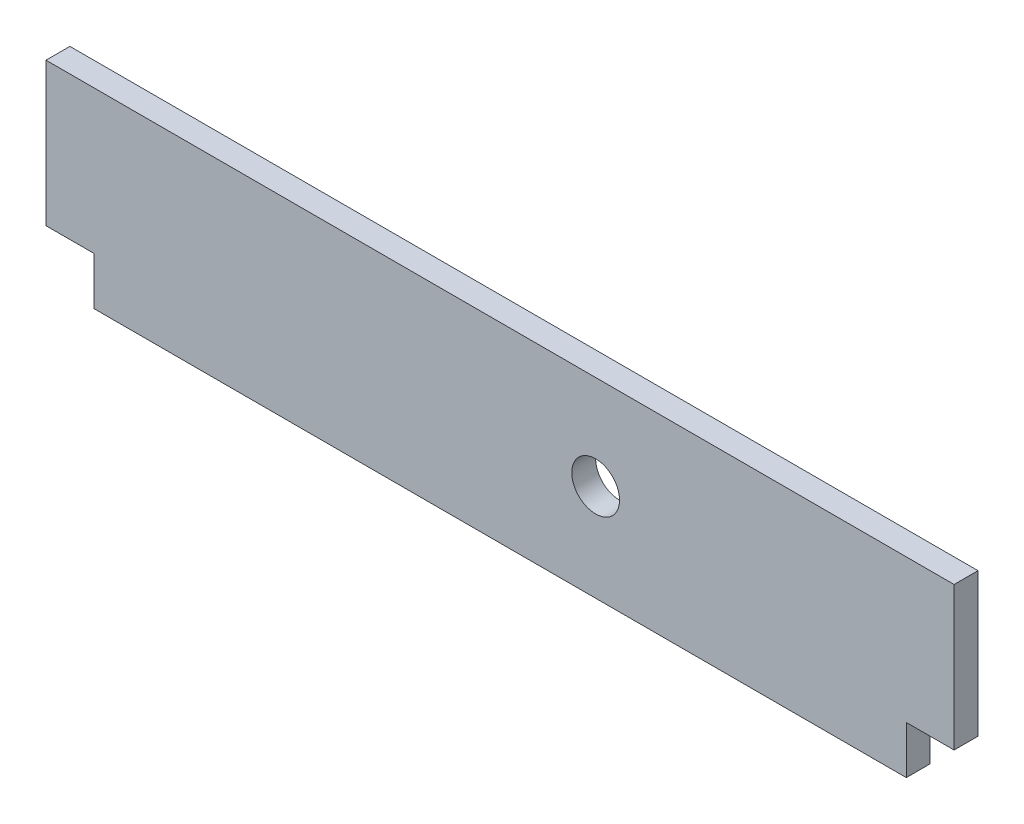
ISO-10303-21;
HEADER;
FILE_DESCRIPTION(('STEP AP214'),'2;1');
FILE_NAME('part.step','',(''),(''),'','','');
FILE_SCHEMA(('AUTOMOTIVE_DESIGN { 1 0 10303 214 1 1 1 1 }'));
ENDSEC;
DATA;
#1=APPLICATION_CONTEXT('core data for automotive mechanical design processes');
#2=APPLICATION_PROTOCOL_DEFINITION('international standard','automotive_design',2000,#1);
#3=PRODUCT_CONTEXT('',#1,'mechanical');
#4=PRODUCT('Part','Part','',(#3));
#5=PRODUCT_RELATED_PRODUCT_CATEGORY('part','',(#4));
#6=PRODUCT_DEFINITION_FORMATION('','',#4);
#7=PRODUCT_DEFINITION_CONTEXT('part definition',#1,'design');
#8=PRODUCT_DEFINITION('design','',#6,#7);
#9=PRODUCT_DEFINITION_SHAPE('','',#8);
#10=(LENGTH_UNIT() NAMED_UNIT(*) SI_UNIT(.MILLI.,.METRE.));
#11=(NAMED_UNIT(*) PLANE_ANGLE_UNIT() SI_UNIT($,.RADIAN.));
#12=(NAMED_UNIT(*) SI_UNIT($,.STERADIAN.) SOLID_ANGLE_UNIT());
#13=UNCERTAINTY_MEASURE_WITH_UNIT(LENGTH_MEASURE(1.E-05),#10,'distance_accuracy_value','');
#14=(GEOMETRIC_REPRESENTATION_CONTEXT(3) GLOBAL_UNCERTAINTY_ASSIGNED_CONTEXT((#13)) GLOBAL_UNIT_ASSIGNED_CONTEXT((#10,
#11,#12)) REPRESENTATION_CONTEXT('',''));
#15=CARTESIAN_POINT('',(0.,0.,0.));
#16=DIRECTION('',(0.,0.,1.));
#17=DIRECTION('',(1.,0.,0.));
#18=AXIS2_PLACEMENT_3D('',#15,#16,#17);
#19=CARTESIAN_POINT('',(215.9,0.,6.35));
#20=DIRECTION('',(-1.,0.,0.));
#21=DIRECTION('',(0.,-1.,0.));
#22=AXIS2_PLACEMENT_3D('',#19,#20,#21);
#23=PLANE('',#22);
#24=DIRECTION('',(0.,1.,0.));
#25=VECTOR('',#24,1.);
#26=CARTESIAN_POINT('',(215.9,0.,-6.35));
#27=LINE('',#26,#25);
#28=CARTESIAN_POINT('',(215.9,0.,-6.35));
#29=VERTEX_POINT('',#28);
#30=CARTESIAN_POINT('',(215.9,25.3999999999999,-6.35));
#31=VERTEX_POINT('',#30);
#32=EDGE_CURVE('E142',#29,#31,#27,.T.);
#33=ORIENTED_EDGE('',*,*,#32,.T.);
#34=DIRECTION('',(0.,0.,-1.));
#35=VECTOR('',#34,1.);
#36=CARTESIAN_POINT('',(215.9,25.3999999999999,6.35));
#37=LINE('',#36,#35);
#38=CARTESIAN_POINT('',(215.9,25.3999999999999,6.35));
#39=VERTEX_POINT('',#38);
#40=EDGE_CURVE('E122',#39,#31,#37,.T.);
#41=ORIENTED_EDGE('',*,*,#40,.F.);
#42=DIRECTION('',(0.,1.,0.));
#43=VECTOR('',#42,1.);
#44=CARTESIAN_POINT('',(215.9,0.,6.35));
#45=LINE('',#44,#43);
#46=CARTESIAN_POINT('',(215.9,0.,6.35));
#47=VERTEX_POINT('',#46);
#48=EDGE_CURVE('E163',#47,#39,#45,.T.);
#49=ORIENTED_EDGE('',*,*,#48,.F.);
#50=DIRECTION('',(0.,0.,-1.));
#51=VECTOR('',#50,1.);
#52=CARTESIAN_POINT('',(215.9,0.,6.35));
#53=LINE('',#52,#51);
#54=EDGE_CURVE('E125',#47,#29,#53,.T.);
#55=ORIENTED_EDGE('',*,*,#54,.T.);
#56=EDGE_LOOP('',(#33,#41,#49,#55));
#57=FACE_BOUND('',#56,.T.);
#58=ADVANCED_FACE('F42',(#57),#23,.F.);
#59=CARTESIAN_POINT('',(215.9,25.3999999999999,6.35));
#60=DIRECTION('',(0.,1.,0.));
#61=DIRECTION('',(-1.,0.,0.));
#62=AXIS2_PLACEMENT_3D('',#59,#60,#61);
#63=PLANE('',#62);
#64=DIRECTION('',(1.,0.,0.));
#65=VECTOR('',#64,1.);
#66=CARTESIAN_POINT('',(215.9,25.3999999999999,-6.35));
#67=LINE('',#66,#65);
#68=CARTESIAN_POINT('',(241.3,25.3999999999999,-6.35));
#69=VERTEX_POINT('',#68);
#70=EDGE_CURVE('E60',#31,#69,#67,.T.);
#71=ORIENTED_EDGE('',*,*,#70,.T.);
#72=DIRECTION('',(0.,0.,-1.));
#73=VECTOR('',#72,1.);
#74=CARTESIAN_POINT('',(241.3,25.3999999999999,6.35));
#75=LINE('',#74,#73);
#76=CARTESIAN_POINT('',(241.3,25.3999999999999,6.35));
#77=VERTEX_POINT('',#76);
#78=EDGE_CURVE('E119',#77,#69,#75,.T.);
#79=ORIENTED_EDGE('',*,*,#78,.F.);
#80=DIRECTION('',(1.,0.,0.));
#81=VECTOR('',#80,1.);
#82=CARTESIAN_POINT('',(215.9,25.3999999999999,6.35));
#83=LINE('',#82,#81);
#84=EDGE_CURVE('E88',#39,#77,#83,.T.);
#85=ORIENTED_EDGE('',*,*,#84,.F.);
#86=ORIENTED_EDGE('',*,*,#40,.T.);
#87=EDGE_LOOP('',(#71,#79,#85,#86));
#88=FACE_BOUND('',#87,.T.);
#89=ADVANCED_FACE('F118',(#88),#63,.F.);
#90=CARTESIAN_POINT('',(241.3,101.6,6.35));
#91=DIRECTION('',(-1.,0.,0.));
#92=DIRECTION('',(0.,-1.,0.));
#93=AXIS2_PLACEMENT_3D('',#90,#91,#92);
#94=PLANE('',#93);
#95=DIRECTION('',(0.,1.,0.));
#96=VECTOR('',#95,1.);
#97=CARTESIAN_POINT('',(241.3,101.6,-6.35));
#98=LINE('',#97,#96);
#99=CARTESIAN_POINT('',(241.3,101.6,-6.35));
#100=VERTEX_POINT('',#99);
#101=EDGE_CURVE('E115',#69,#100,#98,.T.);
#102=ORIENTED_EDGE('',*,*,#101,.T.);
#103=DIRECTION('',(0.,0.,-1.));
#104=VECTOR('',#103,1.);
#105=CARTESIAN_POINT('',(241.3,101.6,6.35));
#106=LINE('',#105,#104);
#107=CARTESIAN_POINT('',(241.3,101.6,6.35));
#108=VERTEX_POINT('',#107);
#109=EDGE_CURVE('E188',#108,#100,#106,.T.);
#110=ORIENTED_EDGE('',*,*,#109,.F.);
#111=DIRECTION('',(0.,1.,0.));
#112=VECTOR('',#111,1.);
#113=CARTESIAN_POINT('',(241.3,101.6,6.35));
#114=LINE('',#113,#112);
#115=EDGE_CURVE('E128',#77,#108,#114,.T.);
#116=ORIENTED_EDGE('',*,*,#115,.F.);
#117=ORIENTED_EDGE('',*,*,#78,.T.);
#118=EDGE_LOOP('',(#102,#110,#116,#117));
#119=FACE_BOUND('',#118,.T.);
#120=ADVANCED_FACE('F127',(#119),#94,.F.);
#121=CARTESIAN_POINT('',(-241.3,101.6,6.35));
#122=DIRECTION('',(0.,-1.,0.));
#123=DIRECTION('',(1.,0.,0.));
#124=AXIS2_PLACEMENT_3D('',#121,#122,#123);
#125=PLANE('',#124);
#126=DIRECTION('',(-1.,0.,0.));
#127=VECTOR('',#126,1.);
#128=CARTESIAN_POINT('',(-241.3,101.6,-6.35));
#129=LINE('',#128,#127);
#130=CARTESIAN_POINT('',(-241.3,101.6,-6.35));
#131=VERTEX_POINT('',#130);
#132=EDGE_CURVE('E130',#100,#131,#129,.T.);
#133=ORIENTED_EDGE('',*,*,#132,.T.);
#134=DIRECTION('',(0.,0.,-1.));
#135=VECTOR('',#134,1.);
#136=CARTESIAN_POINT('',(-241.3,101.6,6.35));
#137=LINE('',#136,#135);
#138=CARTESIAN_POINT('',(-241.3,101.6,6.35));
#139=VERTEX_POINT('',#138);
#140=EDGE_CURVE('E185',#139,#131,#137,.T.);
#141=ORIENTED_EDGE('',*,*,#140,.F.);
#142=DIRECTION('',(-1.,0.,0.));
#143=VECTOR('',#142,1.);
#144=CARTESIAN_POINT('',(-241.3,101.6,6.35));
#145=LINE('',#144,#143);
#146=EDGE_CURVE('E157',#108,#139,#145,.T.);
#147=ORIENTED_EDGE('',*,*,#146,.F.);
#148=ORIENTED_EDGE('',*,*,#109,.T.);
#149=EDGE_LOOP('',(#133,#141,#147,#148));
#150=FACE_BOUND('',#149,.T.);
#151=ADVANCED_FACE('F215',(#150),#125,.F.);
#152=CARTESIAN_POINT('',(-241.3,101.6,6.35));
#153=DIRECTION('',(1.,0.,0.));
#154=DIRECTION('',(0.,0.,-1.));
#155=AXIS2_PLACEMENT_3D('',#152,#153,#154);
#156=PLANE('',#155);
#157=DIRECTION('',(0.,-1.,0.));
#158=VECTOR('',#157,1.);
#159=CARTESIAN_POINT('',(-241.3,101.6,-6.35));
#160=LINE('',#159,#158);
#161=CARTESIAN_POINT('',(-241.3,25.4,-6.35));
#162=VERTEX_POINT('',#161);
#163=EDGE_CURVE('E186',#131,#162,#160,.T.);
#164=ORIENTED_EDGE('',*,*,#163,.T.);
#165=DIRECTION('',(0.,0.,-1.));
#166=VECTOR('',#165,1.);
#167=CARTESIAN_POINT('',(-241.3,25.4,6.35));
#168=LINE('',#167,#166);
#169=CARTESIAN_POINT('',(-241.3,25.4,6.35));
#170=VERTEX_POINT('',#169);
#171=EDGE_CURVE('E182',#170,#162,#168,.T.);
#172=ORIENTED_EDGE('',*,*,#171,.F.);
#173=DIRECTION('',(0.,-1.,0.));
#174=VECTOR('',#173,1.);
#175=CARTESIAN_POINT('',(-241.3,101.6,6.35));
#176=LINE('',#175,#174);
#177=EDGE_CURVE('E154',#139,#170,#176,.T.);
#178=ORIENTED_EDGE('',*,*,#177,.F.);
#179=ORIENTED_EDGE('',*,*,#140,.T.);
#180=EDGE_LOOP('',(#164,#172,#178,#179));
#181=FACE_BOUND('',#180,.T.);
#182=ADVANCED_FACE('F214',(#181),#156,.F.);
#183=CARTESIAN_POINT('',(-215.9,25.4,6.35));
#184=DIRECTION('',(0.,1.,0.));
#185=DIRECTION('',(0.,0.,1.));
#186=AXIS2_PLACEMENT_3D('',#183,#184,#185);
#187=PLANE('',#186);
#188=DIRECTION('',(1.,0.,0.));
#189=VECTOR('',#188,1.);
#190=CARTESIAN_POINT('',(-215.9,25.4,-6.35));
#191=LINE('',#190,#189);
#192=CARTESIAN_POINT('',(-215.9,25.4,-6.35));
#193=VERTEX_POINT('',#192);
#194=EDGE_CURVE('E183',#162,#193,#191,.T.);
#195=ORIENTED_EDGE('',*,*,#194,.T.);
#196=DIRECTION('',(0.,0.,-1.));
#197=VECTOR('',#196,1.);
#198=CARTESIAN_POINT('',(-215.9,25.4,6.35));
#199=LINE('',#198,#197);
#200=CARTESIAN_POINT('',(-215.9,25.4,6.35));
#201=VERTEX_POINT('',#200);
#202=EDGE_CURVE('E172',#201,#193,#199,.T.);
#203=ORIENTED_EDGE('',*,*,#202,.F.);
#204=DIRECTION('',(1.,0.,0.));
#205=VECTOR('',#204,1.);
#206=CARTESIAN_POINT('',(-215.9,25.4,6.35));
#207=LINE('',#206,#205);
#208=EDGE_CURVE('E151',#170,#201,#207,.T.);
#209=ORIENTED_EDGE('',*,*,#208,.F.);
#210=ORIENTED_EDGE('',*,*,#171,.T.);
#211=EDGE_LOOP('',(#195,#203,#209,#210));
#212=FACE_BOUND('',#211,.T.);
#213=ADVANCED_FACE('F204',(#212),#187,.F.);
#214=CARTESIAN_POINT('',(-215.9,25.4,6.35));
#215=DIRECTION('',(1.,0.,0.));
#216=DIRECTION('',(0.,0.,-1.));
#217=AXIS2_PLACEMENT_3D('',#214,#215,#216);
#218=PLANE('',#217);
#219=DIRECTION('',(0.,-1.,0.));
#220=VECTOR('',#219,1.);
#221=CARTESIAN_POINT('',(-215.9,25.4,-6.35));
#222=LINE('',#221,#220);
#223=CARTESIAN_POINT('',(-215.9,0.,-6.35));
#224=VERTEX_POINT('',#223);
#225=EDGE_CURVE('E179',#193,#224,#222,.T.);
#226=ORIENTED_EDGE('',*,*,#225,.T.);
#227=DIRECTION('',(0.,0.,-1.));
#228=VECTOR('',#227,1.);
#229=CARTESIAN_POINT('',(-215.9,0.,6.35));
#230=LINE('',#229,#228);
#231=CARTESIAN_POINT('',(-215.9,0.,6.35));
#232=VERTEX_POINT('',#231);
#233=EDGE_CURVE('E165',#232,#224,#230,.T.);
#234=ORIENTED_EDGE('',*,*,#233,.F.);
#235=DIRECTION('',(0.,-1.,0.));
#236=VECTOR('',#235,1.);
#237=CARTESIAN_POINT('',(-215.9,25.4,6.35));
#238=LINE('',#237,#236);
#239=EDGE_CURVE('E148',#201,#232,#238,.T.);
#240=ORIENTED_EDGE('',*,*,#239,.F.);
#241=ORIENTED_EDGE('',*,*,#202,.T.);
#242=EDGE_LOOP('',(#226,#234,#240,#241));
#243=FACE_BOUND('',#242,.T.);
#244=ADVANCED_FACE('F210',(#243),#218,.F.);
#245=CARTESIAN_POINT('',(-215.9,0.,6.35));
#246=DIRECTION('',(0.,1.,0.));
#247=DIRECTION('',(0.,0.,1.));
#248=AXIS2_PLACEMENT_3D('',#245,#246,#247);
#249=PLANE('',#248);
#250=DIRECTION('',(1.,0.,0.));
#251=VECTOR('',#250,1.);
#252=CARTESIAN_POINT('',(-215.9,0.,-6.35));
#253=LINE('',#252,#251);
#254=EDGE_CURVE('E97',#224,#29,#253,.T.);
#255=ORIENTED_EDGE('',*,*,#254,.T.);
#256=ORIENTED_EDGE('',*,*,#54,.F.);
#257=DIRECTION('',(1.,0.,0.));
#258=VECTOR('',#257,1.);
#259=CARTESIAN_POINT('',(-215.9,0.,6.35));
#260=LINE('',#259,#258);
#261=EDGE_CURVE('E145',#232,#47,#260,.T.);
#262=ORIENTED_EDGE('',*,*,#261,.F.);
#263=ORIENTED_EDGE('',*,*,#233,.T.);
#264=EDGE_LOOP('',(#255,#256,#262,#263));
#265=FACE_BOUND('',#264,.T.);
#266=ADVANCED_FACE('F231',(#265),#249,.F.);
#267=CARTESIAN_POINT('',(0.,0.,6.35));
#268=DIRECTION('',(0.,0.,-1.));
#269=DIRECTION('',(-1.,0.,0.));
#270=AXIS2_PLACEMENT_3D('',#267,#268,#269);
#271=PLANE('',#270);
#272=CARTESIAN_POINT('',(50.8000000000006,51.5000000000016,6.34999999999999));
#273=DIRECTION('',(0.,0.,-1.));
#274=DIRECTION('',(-1.,0.,0.));
#275=AXIS2_PLACEMENT_3D('',#272,#273,#274);
#276=CIRCLE('',#275,12.7000000000001);
#277=CARTESIAN_POINT('',(38.1000000000005,51.5000000000016,6.34999999999999));
#278=VERTEX_POINT('',#277);
#279=EDGE_CURVE('E11',#278,#278,#276,.F.);
#280=ORIENTED_EDGE('',*,*,#279,.F.);
#281=EDGE_LOOP('',(#280));
#282=FACE_BOUND('',#281,.T.);
#283=ORIENTED_EDGE('',*,*,#48,.T.);
#284=ORIENTED_EDGE('',*,*,#84,.T.);
#285=ORIENTED_EDGE('',*,*,#115,.T.);
#286=ORIENTED_EDGE('',*,*,#146,.T.);
#287=ORIENTED_EDGE('',*,*,#177,.T.);
#288=ORIENTED_EDGE('',*,*,#208,.T.);
#289=ORIENTED_EDGE('',*,*,#239,.T.);
#290=ORIENTED_EDGE('',*,*,#261,.T.);
#291=EDGE_LOOP('',(#283,#284,#285,#286,#287,#288,#289,#290));
#292=FACE_BOUND('',#291,.T.);
#293=ADVANCED_FACE('F44',(#282,#292),#271,.F.);
#294=CARTESIAN_POINT('',(0.,0.,-6.35));
#295=DIRECTION('',(0.,0.,-1.));
#296=DIRECTION('',(-1.,0.,0.));
#297=AXIS2_PLACEMENT_3D('',#294,#295,#296);
#298=PLANE('',#297);
#299=CARTESIAN_POINT('',(50.8000000000006,51.5000000000016,-6.34999999999999));
#300=DIRECTION('',(0.,0.,-1.));
#301=DIRECTION('',(-1.,0.,0.));
#302=AXIS2_PLACEMENT_3D('',#299,#300,#301);
#303=CIRCLE('',#302,12.7000000000001);
#304=CARTESIAN_POINT('',(38.1000000000005,51.5000000000016,-6.34999999999999));
#305=VERTEX_POINT('',#304);
#306=EDGE_CURVE('E52',#305,#305,#303,.F.);
#307=ORIENTED_EDGE('',*,*,#306,.T.);
#308=EDGE_LOOP('',(#307));
#309=FACE_BOUND('',#308,.T.);
#310=ORIENTED_EDGE('',*,*,#32,.F.);
#311=ORIENTED_EDGE('',*,*,#254,.F.);
#312=ORIENTED_EDGE('',*,*,#225,.F.);
#313=ORIENTED_EDGE('',*,*,#194,.F.);
#314=ORIENTED_EDGE('',*,*,#163,.F.);
#315=ORIENTED_EDGE('',*,*,#132,.F.);
#316=ORIENTED_EDGE('',*,*,#101,.F.);
#317=ORIENTED_EDGE('',*,*,#70,.F.);
#318=EDGE_LOOP('',(#310,#311,#312,#313,#314,#315,#316,#317));
#319=FACE_BOUND('',#318,.T.);
#320=ADVANCED_FACE('F133',(#309,#319),#298,.T.);
#321=CARTESIAN_POINT('',(50.8000000000006,51.5000000000017,-101.056542434233));
#322=DIRECTION('',(0.,0.,1.));
#323=DIRECTION('',(0.,-1.,0.));
#324=AXIS2_PLACEMENT_3D('',#321,#322,#323);
#325=CYLINDRICAL_SURFACE('',#324,12.7000000000001);
#326=ORIENTED_EDGE('',*,*,#306,.F.);
#327=EDGE_LOOP('',(#326));
#328=FACE_BOUND('',#327,.T.);
#329=ORIENTED_EDGE('',*,*,#279,.T.);
#330=EDGE_LOOP('',(#329));
#331=FACE_BOUND('',#330,.T.);
#332=ADVANCED_FACE('F242',(#328,#331),#325,.F.);
#333=CLOSED_SHELL('',(#58,#89,#120,#151,#182,#213,#244,#266,#293,#320,#332));
#334=MANIFOLD_SOLID_BREP('B2',#333);
#335=ADVANCED_BREP_SHAPE_REPRESENTATION('',(#18,#334),#14);
#336=SHAPE_DEFINITION_REPRESENTATION(#9,#335);
ENDSEC;
END-ISO-10303-21;
